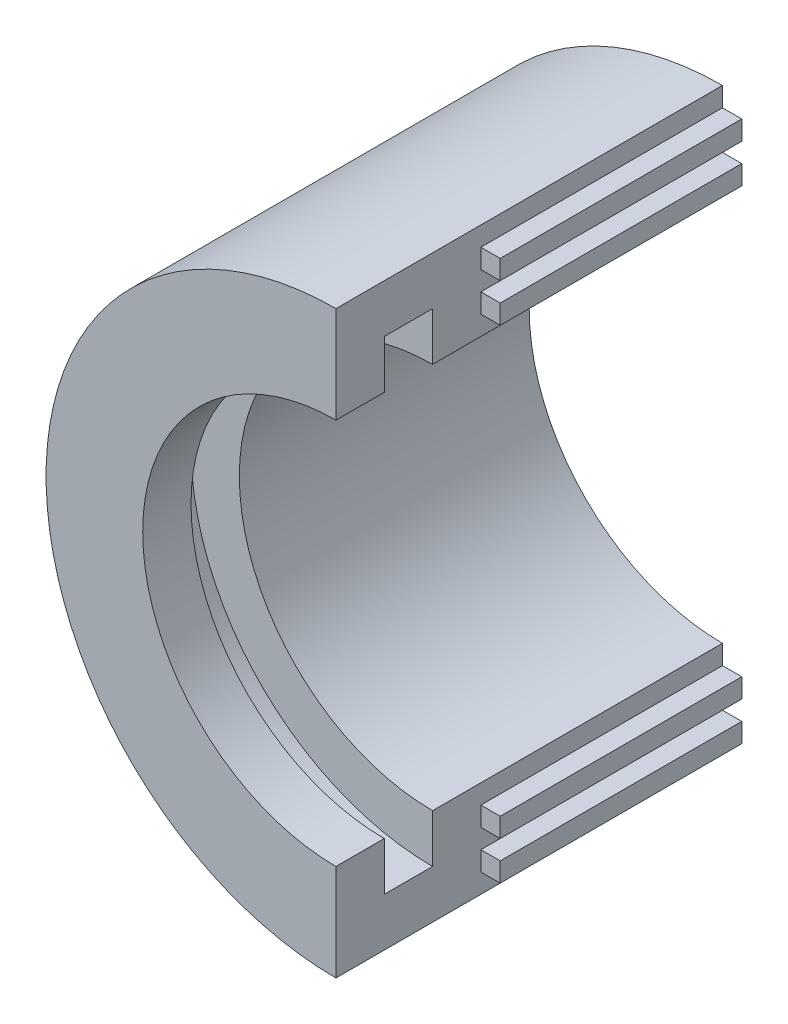
ISO-10303-21;
HEADER;
FILE_DESCRIPTION(('STEP AP214'),'2;1');
FILE_NAME('part.step','',(''),(''),'','','');
FILE_SCHEMA(('AUTOMOTIVE_DESIGN { 1 0 10303 214 1 1 1 1 }'));
ENDSEC;
DATA;
#1=APPLICATION_CONTEXT('core data for automotive mechanical design processes');
#2=APPLICATION_PROTOCOL_DEFINITION('international standard','automotive_design',2000,#1);
#3=PRODUCT_CONTEXT('',#1,'mechanical');
#4=PRODUCT('Part','Part','',(#3));
#5=PRODUCT_RELATED_PRODUCT_CATEGORY('part','',(#4));
#6=PRODUCT_DEFINITION_FORMATION('','',#4);
#7=PRODUCT_DEFINITION_CONTEXT('part definition',#1,'design');
#8=PRODUCT_DEFINITION('design','',#6,#7);
#9=PRODUCT_DEFINITION_SHAPE('','',#8);
#10=(LENGTH_UNIT() NAMED_UNIT(*) SI_UNIT(.MILLI.,.METRE.));
#11=(NAMED_UNIT(*) PLANE_ANGLE_UNIT() SI_UNIT($,.RADIAN.));
#12=(NAMED_UNIT(*) SI_UNIT($,.STERADIAN.) SOLID_ANGLE_UNIT());
#13=UNCERTAINTY_MEASURE_WITH_UNIT(LENGTH_MEASURE(1.E-05),#10,'distance_accuracy_value','');
#14=(GEOMETRIC_REPRESENTATION_CONTEXT(3) GLOBAL_UNCERTAINTY_ASSIGNED_CONTEXT((#13)) GLOBAL_UNIT_ASSIGNED_CONTEXT((#10,
#11,#12)) REPRESENTATION_CONTEXT('',''));
#15=CARTESIAN_POINT('',(0.,0.,0.));
#16=DIRECTION('',(0.,0.,1.));
#17=DIRECTION('',(1.,0.,0.));
#18=AXIS2_PLACEMENT_3D('',#15,#16,#17);
#19=CARTESIAN_POINT('',(0.,76.2,0.));
#20=DIRECTION('',(-1.,0.,0.));
#21=DIRECTION('',(0.,0.,1.));
#22=AXIS2_PLACEMENT_3D('',#19,#20,#21);
#23=PLANE('',#22);
#24=DIRECTION('',(0.,0.,1.));
#25=VECTOR('',#24,1.);
#26=CARTESIAN_POINT('',(0.,-66.04,0.));
#27=LINE('',#26,#25);
#28=CARTESIAN_POINT('',(0.,-66.04,0.));
#29=VERTEX_POINT('',#28);
#30=CARTESIAN_POINT('',(0.,-66.04,63.5));
#31=VERTEX_POINT('',#30);
#32=EDGE_CURVE('E261',#29,#31,#27,.T.);
#33=ORIENTED_EDGE('',*,*,#32,.F.);
#34=DIRECTION('',(0.,-1.,0.));
#35=VECTOR('',#34,1.);
#36=CARTESIAN_POINT('',(0.,76.2,0.));
#37=LINE('',#36,#35);
#38=CARTESIAN_POINT('',(0.,-60.96,0.));
#39=VERTEX_POINT('',#38);
#40=EDGE_CURVE('E413',#39,#29,#37,.T.);
#41=ORIENTED_EDGE('',*,*,#40,.F.);
#42=DIRECTION('',(0.,0.,-1.));
#43=VECTOR('',#42,1.);
#44=CARTESIAN_POINT('',(0.,-60.96,0.));
#45=LINE('',#44,#43);
#46=CARTESIAN_POINT('',(0.,-60.96,63.5));
#47=VERTEX_POINT('',#46);
#48=EDGE_CURVE('E292',#47,#39,#45,.T.);
#49=ORIENTED_EDGE('',*,*,#48,.F.);
#50=DIRECTION('',(0.,-1.,0.));
#51=VECTOR('',#50,1.);
#52=CARTESIAN_POINT('',(0.,-55.88,63.5));
#53=LINE('',#52,#51);
#54=CARTESIAN_POINT('',(0.,-55.88,63.5));
#55=VERTEX_POINT('',#54);
#56=EDGE_CURVE('E301',#55,#47,#53,.T.);
#57=ORIENTED_EDGE('',*,*,#56,.F.);
#58=DIRECTION('',(0.,0.,1.));
#59=VECTOR('',#58,1.);
#60=CARTESIAN_POINT('',(0.,-55.88,0.));
#61=LINE('',#60,#59);
#62=CARTESIAN_POINT('',(0.,-55.88,0.));
#63=VERTEX_POINT('',#62);
#64=EDGE_CURVE('E287',#63,#55,#61,.T.);
#65=ORIENTED_EDGE('',*,*,#64,.F.);
#66=CARTESIAN_POINT('',(0.,-50.8,0.));
#67=VERTEX_POINT('',#66);
#68=EDGE_CURVE('E321',#67,#63,#37,.T.);
#69=ORIENTED_EDGE('',*,*,#68,.F.);
#70=DIRECTION('',(0.,0.,-1.));
#71=VECTOR('',#70,1.);
#72=CARTESIAN_POINT('',(0.,-50.8,101.6));
#73=LINE('',#72,#71);
#74=CARTESIAN_POINT('',(0.,-50.8,76.2));
#75=VERTEX_POINT('',#74);
#76=EDGE_CURVE('E41',#75,#67,#73,.T.);
#77=ORIENTED_EDGE('',*,*,#76,.F.);
#78=DIRECTION('',(0.,-1.,0.));
#79=VECTOR('',#78,1.);
#80=CARTESIAN_POINT('',(0.,0.,76.2));
#81=LINE('',#80,#79);
#82=CARTESIAN_POINT('',(0.,-63.5,76.2));
#83=VERTEX_POINT('',#82);
#84=EDGE_CURVE('E328',#75,#83,#81,.T.);
#85=ORIENTED_EDGE('',*,*,#84,.T.);
#86=DIRECTION('',(0.,0.,1.));
#87=VECTOR('',#86,1.);
#88=CARTESIAN_POINT('',(0.,-63.5,76.2));
#89=LINE('',#88,#87);
#90=CARTESIAN_POINT('',(0.,-63.5,88.9));
#91=VERTEX_POINT('',#90);
#92=EDGE_CURVE('E331',#91,#83,#89,.F.);
#93=ORIENTED_EDGE('',*,*,#92,.F.);
#94=DIRECTION('',(0.,-1.,0.));
#95=VECTOR('',#94,1.);
#96=CARTESIAN_POINT('',(0.,0.,88.9));
#97=LINE('',#96,#95);
#98=CARTESIAN_POINT('',(0.,-50.8,88.9));
#99=VERTEX_POINT('',#98);
#100=EDGE_CURVE('E335',#99,#91,#97,.T.);
#101=ORIENTED_EDGE('',*,*,#100,.F.);
#102=DIRECTION('',(0.,0.,1.));
#103=VECTOR('',#102,1.);
#104=CARTESIAN_POINT('',(0.,-50.8,88.9));
#105=LINE('',#104,#103);
#106=CARTESIAN_POINT('',(0.,-50.8,101.6));
#107=VERTEX_POINT('',#106);
#108=EDGE_CURVE('E338',#107,#99,#105,.F.);
#109=ORIENTED_EDGE('',*,*,#108,.F.);
#110=DIRECTION('',(0.,-1.,0.));
#111=VECTOR('',#110,1.);
#112=CARTESIAN_POINT('',(0.,76.2,101.6));
#113=LINE('',#112,#111);
#114=CARTESIAN_POINT('',(0.,-76.2,101.6));
#115=VERTEX_POINT('',#114);
#116=EDGE_CURVE('E317',#107,#115,#113,.T.);
#117=ORIENTED_EDGE('',*,*,#116,.T.);
#118=DIRECTION('',(0.,0.,1.));
#119=VECTOR('',#118,1.);
#120=CARTESIAN_POINT('',(0.,-76.2,0.));
#121=LINE('',#120,#119);
#122=CARTESIAN_POINT('',(0.,-76.2,0.));
#123=VERTEX_POINT('',#122);
#124=EDGE_CURVE('E325',#123,#115,#121,.T.);
#125=ORIENTED_EDGE('',*,*,#124,.F.);
#126=CARTESIAN_POINT('',(0.,-71.12,0.));
#127=VERTEX_POINT('',#126);
#128=EDGE_CURVE('E324',#127,#123,#37,.T.);
#129=ORIENTED_EDGE('',*,*,#128,.F.);
#130=DIRECTION('',(0.,0.,-1.));
#131=VECTOR('',#130,1.);
#132=CARTESIAN_POINT('',(0.,-71.12,0.));
#133=LINE('',#132,#131);
#134=CARTESIAN_POINT('',(0.,-71.12,63.5));
#135=VERTEX_POINT('',#134);
#136=EDGE_CURVE('E266',#135,#127,#133,.T.);
#137=ORIENTED_EDGE('',*,*,#136,.F.);
#138=DIRECTION('',(0.,-1.,0.));
#139=VECTOR('',#138,1.);
#140=CARTESIAN_POINT('',(0.,-66.04,63.5));
#141=LINE('',#140,#139);
#142=EDGE_CURVE('E274',#31,#135,#141,.T.);
#143=ORIENTED_EDGE('',*,*,#142,.F.);
#144=EDGE_LOOP('',(#33,#41,#49,#57,#65,#69,#77,#85,#93,#101,#109,#117,#125,#129,#137,#143));
#145=FACE_BOUND('',#144,.T.);
#146=ADVANCED_FACE('F33',(#145),#23,.F.);
#147=CARTESIAN_POINT('',(0.,0.,101.6));
#148=DIRECTION('',(0.,0.,-1.));
#149=DIRECTION('',(-1.,0.,0.));
#150=AXIS2_PLACEMENT_3D('',#147,#148,#149);
#151=CYLINDRICAL_SURFACE('',#150,76.2);
#152=CARTESIAN_POINT('',(0.,0.,101.6));
#153=DIRECTION('',(0.,0.,1.));
#154=DIRECTION('',(1.,0.,0.));
#155=AXIS2_PLACEMENT_3D('',#152,#153,#154);
#156=CIRCLE('',#155,76.2);
#157=CARTESIAN_POINT('',(0.,76.2,101.6));
#158=VERTEX_POINT('',#157);
#159=EDGE_CURVE('E362',#158,#115,#156,.T.);
#160=ORIENTED_EDGE('',*,*,#159,.F.);
#161=DIRECTION('',(0.,0.,1.));
#162=VECTOR('',#161,1.);
#163=CARTESIAN_POINT('',(0.,76.2,0.));
#164=LINE('',#163,#162);
#165=CARTESIAN_POINT('',(0.,76.2,0.));
#166=VERTEX_POINT('',#165);
#167=EDGE_CURVE('E319',#166,#158,#164,.T.);
#168=ORIENTED_EDGE('',*,*,#167,.F.);
#169=CARTESIAN_POINT('',(0.,0.,0.));
#170=DIRECTION('',(0.,0.,1.));
#171=DIRECTION('',(1.,0.,0.));
#172=AXIS2_PLACEMENT_3D('',#169,#170,#171);
#173=CIRCLE('',#172,76.2);
#174=EDGE_CURVE('E361',#166,#123,#173,.T.);
#175=ORIENTED_EDGE('',*,*,#174,.T.);
#176=ORIENTED_EDGE('',*,*,#124,.T.);
#177=EDGE_LOOP('',(#160,#168,#175,#176));
#178=FACE_BOUND('',#177,.T.);
#179=ADVANCED_FACE('F35',(#178),#151,.T.);
#180=CARTESIAN_POINT('',(0.,0.,101.6));
#181=DIRECTION('',(0.,0.,1.));
#182=DIRECTION('',(1.,0.,0.));
#183=AXIS2_PLACEMENT_3D('',#180,#181,#182);
#184=PLANE('',#183);
#185=CARTESIAN_POINT('',(0.,50.8,101.6));
#186=VERTEX_POINT('',#185);
#187=EDGE_CURVE('E322',#158,#186,#113,.T.);
#188=ORIENTED_EDGE('',*,*,#187,.F.);
#189=ORIENTED_EDGE('',*,*,#159,.T.);
#190=ORIENTED_EDGE('',*,*,#116,.F.);
#191=CARTESIAN_POINT('',(0.,0.,101.6));
#192=DIRECTION('',(0.,0.,1.));
#193=DIRECTION('',(1.,0.,0.));
#194=AXIS2_PLACEMENT_3D('',#191,#192,#193);
#195=CIRCLE('',#194,50.8);
#196=EDGE_CURVE('E356',#186,#107,#195,.T.);
#197=ORIENTED_EDGE('',*,*,#196,.F.);
#198=EDGE_LOOP('',(#188,#189,#190,#197));
#199=FACE_BOUND('',#198,.T.);
#200=ADVANCED_FACE('F404',(#199),#184,.T.);
#201=CARTESIAN_POINT('',(0.,0.,0.));
#202=DIRECTION('',(0.,0.,1.));
#203=DIRECTION('',(1.,0.,0.));
#204=AXIS2_PLACEMENT_3D('',#201,#202,#203);
#205=PLANE('',#204);
#206=ORIENTED_EDGE('',*,*,#174,.F.);
#207=CARTESIAN_POINT('',(0.,71.12,0.));
#208=VERTEX_POINT('',#207);
#209=EDGE_CURVE('E200',#166,#208,#37,.T.);
#210=ORIENTED_EDGE('',*,*,#209,.T.);
#211=DIRECTION('',(-1.,0.,0.));
#212=VECTOR('',#211,1.);
#213=CARTESIAN_POINT('',(5.08,71.12,0.));
#214=LINE('',#213,#212);
#215=CARTESIAN_POINT('',(5.08,71.12,0.));
#216=VERTEX_POINT('',#215);
#217=EDGE_CURVE('E194',#216,#208,#214,.T.);
#218=ORIENTED_EDGE('',*,*,#217,.F.);
#219=DIRECTION('',(0.,-1.,0.));
#220=VECTOR('',#219,1.);
#221=CARTESIAN_POINT('',(5.08,66.04,0.));
#222=LINE('',#221,#220);
#223=CARTESIAN_POINT('',(5.08,66.04,0.));
#224=VERTEX_POINT('',#223);
#225=EDGE_CURVE('E198',#216,#224,#222,.T.);
#226=ORIENTED_EDGE('',*,*,#225,.T.);
#227=DIRECTION('',(-1.,0.,0.));
#228=VECTOR('',#227,1.);
#229=CARTESIAN_POINT('',(5.08,66.04,0.));
#230=LINE('',#229,#228);
#231=CARTESIAN_POINT('',(0.,66.04,0.));
#232=VERTEX_POINT('',#231);
#233=EDGE_CURVE('E224',#224,#232,#230,.T.);
#234=ORIENTED_EDGE('',*,*,#233,.T.);
#235=CARTESIAN_POINT('',(0.,60.96,0.));
#236=VERTEX_POINT('',#235);
#237=EDGE_CURVE('E320',#232,#236,#37,.T.);
#238=ORIENTED_EDGE('',*,*,#237,.T.);
#239=DIRECTION('',(-1.,0.,0.));
#240=VECTOR('',#239,1.);
#241=CARTESIAN_POINT('',(5.08,60.96,0.));
#242=LINE('',#241,#240);
#243=CARTESIAN_POINT('',(5.08,60.96,0.));
#244=VERTEX_POINT('',#243);
#245=EDGE_CURVE('E258',#244,#236,#242,.T.);
#246=ORIENTED_EDGE('',*,*,#245,.F.);
#247=DIRECTION('',(0.,-1.,0.));
#248=VECTOR('',#247,1.);
#249=CARTESIAN_POINT('',(5.08,55.88,0.));
#250=LINE('',#249,#248);
#251=CARTESIAN_POINT('',(5.08,55.88,0.));
#252=VERTEX_POINT('',#251);
#253=EDGE_CURVE('E234',#244,#252,#250,.T.);
#254=ORIENTED_EDGE('',*,*,#253,.T.);
#255=DIRECTION('',(-1.,0.,0.));
#256=VECTOR('',#255,1.);
#257=CARTESIAN_POINT('',(5.08,55.88,0.));
#258=LINE('',#257,#256);
#259=CARTESIAN_POINT('',(0.,55.88,0.));
#260=VERTEX_POINT('',#259);
#261=EDGE_CURVE('E247',#252,#260,#258,.T.);
#262=ORIENTED_EDGE('',*,*,#261,.T.);
#263=CARTESIAN_POINT('',(0.,50.8,0.));
#264=VERTEX_POINT('',#263);
#265=EDGE_CURVE('E381',#260,#264,#37,.T.);
#266=ORIENTED_EDGE('',*,*,#265,.T.);
#267=CARTESIAN_POINT('',(0.,0.,0.));
#268=DIRECTION('',(0.,0.,-1.));
#269=DIRECTION('',(-1.,0.,0.));
#270=AXIS2_PLACEMENT_3D('',#267,#268,#269);
#271=CIRCLE('',#270,50.8);
#272=EDGE_CURVE('E348',#67,#264,#271,.T.);
#273=ORIENTED_EDGE('',*,*,#272,.F.);
#274=ORIENTED_EDGE('',*,*,#68,.T.);
#275=DIRECTION('',(-1.,0.,0.));
#276=VECTOR('',#275,1.);
#277=CARTESIAN_POINT('',(5.08,-55.88,0.));
#278=LINE('',#277,#276);
#279=CARTESIAN_POINT('',(5.08,-55.88,0.));
#280=VERTEX_POINT('',#279);
#281=EDGE_CURVE('E314',#280,#63,#278,.T.);
#282=ORIENTED_EDGE('',*,*,#281,.F.);
#283=DIRECTION('',(0.,1.,0.));
#284=VECTOR('',#283,1.);
#285=CARTESIAN_POINT('',(5.08,-55.88,0.));
#286=LINE('',#285,#284);
#287=CARTESIAN_POINT('',(5.08,-60.96,0.));
#288=VERTEX_POINT('',#287);
#289=EDGE_CURVE('E288',#288,#280,#286,.T.);
#290=ORIENTED_EDGE('',*,*,#289,.F.);
#291=DIRECTION('',(-1.,0.,0.));
#292=VECTOR('',#291,1.);
#293=CARTESIAN_POINT('',(5.08,-60.96,0.));
#294=LINE('',#293,#292);
#295=EDGE_CURVE('E298',#288,#39,#294,.T.);
#296=ORIENTED_EDGE('',*,*,#295,.T.);
#297=ORIENTED_EDGE('',*,*,#40,.T.);
#298=DIRECTION('',(-1.,0.,0.));
#299=VECTOR('',#298,1.);
#300=CARTESIAN_POINT('',(5.08,-66.04,0.));
#301=LINE('',#300,#299);
#302=CARTESIAN_POINT('',(5.08,-66.04,0.));
#303=VERTEX_POINT('',#302);
#304=EDGE_CURVE('E285',#303,#29,#301,.T.);
#305=ORIENTED_EDGE('',*,*,#304,.F.);
#306=DIRECTION('',(0.,1.,0.));
#307=VECTOR('',#306,1.);
#308=CARTESIAN_POINT('',(5.08,-66.04,0.));
#309=LINE('',#308,#307);
#310=CARTESIAN_POINT('',(5.08,-71.12,0.));
#311=VERTEX_POINT('',#310);
#312=EDGE_CURVE('E262',#311,#303,#309,.T.);
#313=ORIENTED_EDGE('',*,*,#312,.F.);
#314=DIRECTION('',(-1.,0.,0.));
#315=VECTOR('',#314,1.);
#316=CARTESIAN_POINT('',(5.08,-71.12,0.));
#317=LINE('',#316,#315);
#318=EDGE_CURVE('E272',#311,#127,#317,.T.);
#319=ORIENTED_EDGE('',*,*,#318,.T.);
#320=ORIENTED_EDGE('',*,*,#128,.T.);
#321=EDGE_LOOP('',(#206,#210,#218,#226,#234,#238,#246,#254,#262,#266,#273,#274,#282,#290,#296,
#297,#305,#313,#319,#320));
#322=FACE_BOUND('',#321,.T.);
#323=ADVANCED_FACE('F197',(#322),#205,.F.);
#324=CARTESIAN_POINT('',(0.,0.,88.9));
#325=DIRECTION('',(0.,0.,1.));
#326=DIRECTION('',(1.,0.,0.));
#327=AXIS2_PLACEMENT_3D('',#324,#325,#326);
#328=PLANE('',#327);
#329=CARTESIAN_POINT('',(0.,0.,88.9));
#330=DIRECTION('',(0.,0.,1.));
#331=DIRECTION('',(1.,0.,0.));
#332=AXIS2_PLACEMENT_3D('',#329,#330,#331);
#333=CIRCLE('',#332,63.5);
#334=CARTESIAN_POINT('',(0.,63.5,88.9));
#335=VERTEX_POINT('',#334);
#336=EDGE_CURVE('E365',#91,#335,#333,.F.);
#337=ORIENTED_EDGE('',*,*,#336,.T.);
#338=CARTESIAN_POINT('',(0.,50.8,88.9));
#339=VERTEX_POINT('',#338);
#340=EDGE_CURVE('E339',#335,#339,#97,.T.);
#341=ORIENTED_EDGE('',*,*,#340,.T.);
#342=CARTESIAN_POINT('',(0.,0.,88.9));
#343=DIRECTION('',(0.,0.,1.));
#344=DIRECTION('',(1.,0.,0.));
#345=AXIS2_PLACEMENT_3D('',#342,#343,#344);
#346=CIRCLE('',#345,50.8);
#347=EDGE_CURVE('E352',#339,#99,#346,.T.);
#348=ORIENTED_EDGE('',*,*,#347,.T.);
#349=ORIENTED_EDGE('',*,*,#100,.T.);
#350=EDGE_LOOP('',(#337,#341,#348,#349));
#351=FACE_BOUND('',#350,.T.);
#352=ADVANCED_FACE('F396',(#351),#328,.F.);
#353=CARTESIAN_POINT('',(0.,0.,88.9));
#354=DIRECTION('',(0.,0.,1.));
#355=DIRECTION('',(1.,0.,0.));
#356=AXIS2_PLACEMENT_3D('',#353,#354,#355);
#357=CYLINDRICAL_SURFACE('',#356,50.8);
#358=ORIENTED_EDGE('',*,*,#196,.T.);
#359=ORIENTED_EDGE('',*,*,#108,.T.);
#360=ORIENTED_EDGE('',*,*,#347,.F.);
#361=DIRECTION('',(0.,0.,1.));
#362=VECTOR('',#361,1.);
#363=CARTESIAN_POINT('',(0.,50.8,88.9));
#364=LINE('',#363,#362);
#365=EDGE_CURVE('E345',#339,#186,#364,.T.);
#366=ORIENTED_EDGE('',*,*,#365,.T.);
#367=EDGE_LOOP('',(#358,#359,#360,#366));
#368=FACE_BOUND('',#367,.T.);
#369=ADVANCED_FACE('F400',(#368),#357,.F.);
#370=CARTESIAN_POINT('',(0.,0.,76.2));
#371=DIRECTION('',(0.,0.,1.));
#372=DIRECTION('',(1.,0.,0.));
#373=AXIS2_PLACEMENT_3D('',#370,#371,#372);
#374=PLANE('',#373);
#375=CARTESIAN_POINT('',(0.,63.5,76.2));
#376=VERTEX_POINT('',#375);
#377=CARTESIAN_POINT('',(0.,50.8,76.2));
#378=VERTEX_POINT('',#377);
#379=EDGE_CURVE('E332',#376,#378,#81,.T.);
#380=ORIENTED_EDGE('',*,*,#379,.F.);
#381=CARTESIAN_POINT('',(0.,0.,76.2));
#382=DIRECTION('',(0.,0.,1.));
#383=DIRECTION('',(1.,0.,0.));
#384=AXIS2_PLACEMENT_3D('',#381,#382,#383);
#385=CIRCLE('',#384,63.5);
#386=EDGE_CURVE('E355',#376,#83,#385,.T.);
#387=ORIENTED_EDGE('',*,*,#386,.T.);
#388=ORIENTED_EDGE('',*,*,#84,.F.);
#389=CARTESIAN_POINT('',(0.,0.,76.2));
#390=DIRECTION('',(0.,0.,1.));
#391=DIRECTION('',(1.,0.,0.));
#392=AXIS2_PLACEMENT_3D('',#389,#390,#391);
#393=CIRCLE('',#392,50.8);
#394=EDGE_CURVE('E351',#378,#75,#393,.T.);
#395=ORIENTED_EDGE('',*,*,#394,.F.);
#396=EDGE_LOOP('',(#380,#387,#388,#395));
#397=FACE_BOUND('',#396,.T.);
#398=ADVANCED_FACE('F388',(#397),#374,.T.);
#399=CARTESIAN_POINT('',(0.,0.,76.2));
#400=DIRECTION('',(0.,0.,1.));
#401=DIRECTION('',(1.,0.,0.));
#402=AXIS2_PLACEMENT_3D('',#399,#400,#401);
#403=CYLINDRICAL_SURFACE('',#402,63.5);
#404=ORIENTED_EDGE('',*,*,#336,.F.);
#405=ORIENTED_EDGE('',*,*,#92,.T.);
#406=ORIENTED_EDGE('',*,*,#386,.F.);
#407=DIRECTION('',(0.,0.,1.));
#408=VECTOR('',#407,1.);
#409=CARTESIAN_POINT('',(0.,63.5,76.2));
#410=LINE('',#409,#408);
#411=EDGE_CURVE('E342',#376,#335,#410,.T.);
#412=ORIENTED_EDGE('',*,*,#411,.T.);
#413=EDGE_LOOP('',(#404,#405,#406,#412));
#414=FACE_BOUND('',#413,.T.);
#415=ADVANCED_FACE('F393',(#414),#403,.F.);
#416=CARTESIAN_POINT('',(0.,0.,101.6));
#417=DIRECTION('',(0.,0.,-1.));
#418=DIRECTION('',(-1.,0.,0.));
#419=AXIS2_PLACEMENT_3D('',#416,#417,#418);
#420=CYLINDRICAL_SURFACE('',#419,50.8);
#421=ORIENTED_EDGE('',*,*,#272,.T.);
#422=DIRECTION('',(0.,0.,-1.));
#423=VECTOR('',#422,1.);
#424=CARTESIAN_POINT('',(0.,50.8,101.6));
#425=LINE('',#424,#423);
#426=EDGE_CURVE('E11',#264,#378,#425,.F.);
#427=ORIENTED_EDGE('',*,*,#426,.T.);
#428=ORIENTED_EDGE('',*,*,#394,.T.);
#429=ORIENTED_EDGE('',*,*,#76,.T.);
#430=EDGE_LOOP('',(#421,#427,#428,#429));
#431=FACE_BOUND('',#430,.T.);
#432=ADVANCED_FACE('F374',(#431),#420,.F.);
#433=DIRECTION('',(0.,1.,0.));
#434=VECTOR('',#433,1.);
#435=CARTESIAN_POINT('',(0.,66.04,63.5));
#436=LINE('',#435,#434);
#437=CARTESIAN_POINT('',(0.,66.04,63.5));
#438=VERTEX_POINT('',#437);
#439=CARTESIAN_POINT('',(0.,71.12,63.5));
#440=VERTEX_POINT('',#439);
#441=EDGE_CURVE('E48',#438,#440,#436,.T.);
#442=ORIENTED_EDGE('',*,*,#441,.T.);
#443=DIRECTION('',(0.,0.,-1.));
#444=VECTOR('',#443,1.);
#445=CARTESIAN_POINT('',(0.,71.12,0.));
#446=LINE('',#445,#444);
#447=EDGE_CURVE('E225',#440,#208,#446,.T.);
#448=ORIENTED_EDGE('',*,*,#447,.T.);
#449=ORIENTED_EDGE('',*,*,#209,.F.);
#450=ORIENTED_EDGE('',*,*,#167,.T.);
#451=ORIENTED_EDGE('',*,*,#187,.T.);
#452=ORIENTED_EDGE('',*,*,#365,.F.);
#453=ORIENTED_EDGE('',*,*,#340,.F.);
#454=ORIENTED_EDGE('',*,*,#411,.F.);
#455=ORIENTED_EDGE('',*,*,#379,.T.);
#456=ORIENTED_EDGE('',*,*,#426,.F.);
#457=ORIENTED_EDGE('',*,*,#265,.F.);
#458=DIRECTION('',(0.,0.,1.));
#459=VECTOR('',#458,1.);
#460=CARTESIAN_POINT('',(0.,55.88,0.));
#461=LINE('',#460,#459);
#462=CARTESIAN_POINT('',(0.,55.88,63.5));
#463=VERTEX_POINT('',#462);
#464=EDGE_CURVE('E238',#260,#463,#461,.T.);
#465=ORIENTED_EDGE('',*,*,#464,.T.);
#466=DIRECTION('',(0.,1.,0.));
#467=VECTOR('',#466,1.);
#468=CARTESIAN_POINT('',(0.,55.88,63.5));
#469=LINE('',#468,#467);
#470=CARTESIAN_POINT('',(0.,60.96,63.5));
#471=VERTEX_POINT('',#470);
#472=EDGE_CURVE('E56',#463,#471,#469,.T.);
#473=ORIENTED_EDGE('',*,*,#472,.T.);
#474=DIRECTION('',(0.,0.,-1.));
#475=VECTOR('',#474,1.);
#476=CARTESIAN_POINT('',(0.,60.96,0.));
#477=LINE('',#476,#475);
#478=EDGE_CURVE('E205',#471,#236,#477,.T.);
#479=ORIENTED_EDGE('',*,*,#478,.T.);
#480=ORIENTED_EDGE('',*,*,#237,.F.);
#481=DIRECTION('',(0.,0.,1.));
#482=VECTOR('',#481,1.);
#483=CARTESIAN_POINT('',(0.,66.04,0.));
#484=LINE('',#483,#482);
#485=EDGE_CURVE('E216',#232,#438,#484,.T.);
#486=ORIENTED_EDGE('',*,*,#485,.T.);
#487=EDGE_LOOP('',(#442,#448,#449,#450,#451,#452,#453,#454,#455,#456,#457,#465,#473,#479,#480,#486));
#488=FACE_BOUND('',#487,.T.);
#489=ADVANCED_FACE('F385',(#488),#23,.F.);
#490=CARTESIAN_POINT('',(5.08,-55.88,0.));
#491=DIRECTION('',(0.,-1.,0.));
#492=DIRECTION('',(0.,0.,-1.));
#493=AXIS2_PLACEMENT_3D('',#490,#491,#492);
#494=PLANE('',#493);
#495=ORIENTED_EDGE('',*,*,#64,.T.);
#496=DIRECTION('',(-1.,0.,0.));
#497=VECTOR('',#496,1.);
#498=CARTESIAN_POINT('',(5.08,-55.88,63.5));
#499=LINE('',#498,#497);
#500=CARTESIAN_POINT('',(5.08,-55.88,63.5));
#501=VERTEX_POINT('',#500);
#502=EDGE_CURVE('E311',#501,#55,#499,.T.);
#503=ORIENTED_EDGE('',*,*,#502,.F.);
#504=DIRECTION('',(0.,0.,1.));
#505=VECTOR('',#504,1.);
#506=CARTESIAN_POINT('',(5.08,-55.88,0.));
#507=LINE('',#506,#505);
#508=EDGE_CURVE('E291',#280,#501,#507,.T.);
#509=ORIENTED_EDGE('',*,*,#508,.F.);
#510=ORIENTED_EDGE('',*,*,#281,.T.);
#511=EDGE_LOOP('',(#495,#503,#509,#510));
#512=FACE_BOUND('',#511,.T.);
#513=ADVANCED_FACE('F428',(#512),#494,.F.);
#514=CARTESIAN_POINT('',(5.08,-55.88,63.5));
#515=DIRECTION('',(0.,0.,-1.));
#516=DIRECTION('',(-1.,0.,0.));
#517=AXIS2_PLACEMENT_3D('',#514,#515,#516);
#518=PLANE('',#517);
#519=ORIENTED_EDGE('',*,*,#56,.T.);
#520=DIRECTION('',(-1.,0.,0.));
#521=VECTOR('',#520,1.);
#522=CARTESIAN_POINT('',(5.08,-60.96,63.5));
#523=LINE('',#522,#521);
#524=CARTESIAN_POINT('',(5.08,-60.96,63.5));
#525=VERTEX_POINT('',#524);
#526=EDGE_CURVE('E308',#525,#47,#523,.T.);
#527=ORIENTED_EDGE('',*,*,#526,.F.);
#528=DIRECTION('',(0.,-1.,0.));
#529=VECTOR('',#528,1.);
#530=CARTESIAN_POINT('',(5.08,-55.88,63.5));
#531=LINE('',#530,#529);
#532=EDGE_CURVE('E294',#501,#525,#531,.T.);
#533=ORIENTED_EDGE('',*,*,#532,.F.);
#534=ORIENTED_EDGE('',*,*,#502,.T.);
#535=EDGE_LOOP('',(#519,#527,#533,#534));
#536=FACE_BOUND('',#535,.T.);
#537=ADVANCED_FACE('F425',(#536),#518,.F.);
#538=CARTESIAN_POINT('',(5.08,-60.96,0.));
#539=DIRECTION('',(0.,1.,0.));
#540=DIRECTION('',(0.,0.,1.));
#541=AXIS2_PLACEMENT_3D('',#538,#539,#540);
#542=PLANE('',#541);
#543=ORIENTED_EDGE('',*,*,#48,.T.);
#544=ORIENTED_EDGE('',*,*,#295,.F.);
#545=DIRECTION('',(0.,0.,-1.));
#546=VECTOR('',#545,1.);
#547=CARTESIAN_POINT('',(5.08,-60.96,0.));
#548=LINE('',#547,#546);
#549=EDGE_CURVE('E296',#525,#288,#548,.T.);
#550=ORIENTED_EDGE('',*,*,#549,.F.);
#551=ORIENTED_EDGE('',*,*,#526,.T.);
#552=EDGE_LOOP('',(#543,#544,#550,#551));
#553=FACE_BOUND('',#552,.T.);
#554=ADVANCED_FACE('F420',(#553),#542,.F.);
#555=CARTESIAN_POINT('',(5.08,0.,0.));
#556=DIRECTION('',(-1.,0.,0.));
#557=DIRECTION('',(0.,0.,1.));
#558=AXIS2_PLACEMENT_3D('',#555,#556,#557);
#559=PLANE('',#558);
#560=ORIENTED_EDGE('',*,*,#289,.T.);
#561=ORIENTED_EDGE('',*,*,#508,.T.);
#562=ORIENTED_EDGE('',*,*,#532,.T.);
#563=ORIENTED_EDGE('',*,*,#549,.T.);
#564=EDGE_LOOP('',(#560,#561,#562,#563));
#565=FACE_BOUND('',#564,.T.);
#566=ADVANCED_FACE('F430',(#565),#559,.F.);
#567=CARTESIAN_POINT('',(5.08,-66.04,0.));
#568=DIRECTION('',(0.,-1.,0.));
#569=DIRECTION('',(0.,0.,-1.));
#570=AXIS2_PLACEMENT_3D('',#567,#568,#569);
#571=PLANE('',#570);
#572=ORIENTED_EDGE('',*,*,#32,.T.);
#573=DIRECTION('',(-1.,0.,0.));
#574=VECTOR('',#573,1.);
#575=CARTESIAN_POINT('',(5.08,-66.04,63.5));
#576=LINE('',#575,#574);
#577=CARTESIAN_POINT('',(5.08,-66.04,63.5));
#578=VERTEX_POINT('',#577);
#579=EDGE_CURVE('E282',#578,#31,#576,.T.);
#580=ORIENTED_EDGE('',*,*,#579,.F.);
#581=DIRECTION('',(0.,0.,1.));
#582=VECTOR('',#581,1.);
#583=CARTESIAN_POINT('',(5.08,-66.04,0.));
#584=LINE('',#583,#582);
#585=EDGE_CURVE('E265',#303,#578,#584,.T.);
#586=ORIENTED_EDGE('',*,*,#585,.F.);
#587=ORIENTED_EDGE('',*,*,#304,.T.);
#588=EDGE_LOOP('',(#572,#580,#586,#587));
#589=FACE_BOUND('',#588,.T.);
#590=ADVANCED_FACE('F432',(#589),#571,.F.);
#591=CARTESIAN_POINT('',(5.08,-66.04,63.5));
#592=DIRECTION('',(0.,0.,-1.));
#593=DIRECTION('',(-1.,0.,0.));
#594=AXIS2_PLACEMENT_3D('',#591,#592,#593);
#595=PLANE('',#594);
#596=ORIENTED_EDGE('',*,*,#142,.T.);
#597=DIRECTION('',(-1.,0.,0.));
#598=VECTOR('',#597,1.);
#599=CARTESIAN_POINT('',(5.08,-71.12,63.5));
#600=LINE('',#599,#598);
#601=CARTESIAN_POINT('',(5.08,-71.12,63.5));
#602=VERTEX_POINT('',#601);
#603=EDGE_CURVE('E279',#602,#135,#600,.T.);
#604=ORIENTED_EDGE('',*,*,#603,.F.);
#605=DIRECTION('',(0.,-1.,0.));
#606=VECTOR('',#605,1.);
#607=CARTESIAN_POINT('',(5.08,-66.04,63.5));
#608=LINE('',#607,#606);
#609=EDGE_CURVE('E268',#578,#602,#608,.T.);
#610=ORIENTED_EDGE('',*,*,#609,.F.);
#611=ORIENTED_EDGE('',*,*,#579,.T.);
#612=EDGE_LOOP('',(#596,#604,#610,#611));
#613=FACE_BOUND('',#612,.T.);
#614=ADVANCED_FACE('F438',(#613),#595,.F.);
#615=CARTESIAN_POINT('',(5.08,-71.12,0.));
#616=DIRECTION('',(0.,1.,0.));
#617=DIRECTION('',(0.,0.,1.));
#618=AXIS2_PLACEMENT_3D('',#615,#616,#617);
#619=PLANE('',#618);
#620=ORIENTED_EDGE('',*,*,#136,.T.);
#621=ORIENTED_EDGE('',*,*,#318,.F.);
#622=DIRECTION('',(0.,0.,-1.));
#623=VECTOR('',#622,1.);
#624=CARTESIAN_POINT('',(5.08,-71.12,0.));
#625=LINE('',#624,#623);
#626=EDGE_CURVE('E270',#602,#311,#625,.T.);
#627=ORIENTED_EDGE('',*,*,#626,.F.);
#628=ORIENTED_EDGE('',*,*,#603,.T.);
#629=EDGE_LOOP('',(#620,#621,#627,#628));
#630=FACE_BOUND('',#629,.T.);
#631=ADVANCED_FACE('F539',(#630),#619,.F.);
#632=CARTESIAN_POINT('',(5.08,-10.16,0.));
#633=DIRECTION('',(-1.,0.,0.));
#634=DIRECTION('',(0.,0.,1.));
#635=AXIS2_PLACEMENT_3D('',#632,#633,#634);
#636=PLANE('',#635);
#637=ORIENTED_EDGE('',*,*,#312,.T.);
#638=ORIENTED_EDGE('',*,*,#585,.T.);
#639=ORIENTED_EDGE('',*,*,#609,.T.);
#640=ORIENTED_EDGE('',*,*,#626,.T.);
#641=EDGE_LOOP('',(#637,#638,#639,#640));
#642=FACE_BOUND('',#641,.T.);
#643=ADVANCED_FACE('F548',(#642),#636,.F.);
#644=CARTESIAN_POINT('',(5.08,60.96,0.));
#645=DIRECTION('',(0.,1.,0.));
#646=DIRECTION('',(0.,0.,1.));
#647=AXIS2_PLACEMENT_3D('',#644,#645,#646);
#648=PLANE('',#647);
#649=ORIENTED_EDGE('',*,*,#478,.F.);
#650=DIRECTION('',(-1.,0.,0.));
#651=VECTOR('',#650,1.);
#652=CARTESIAN_POINT('',(5.08,60.96,63.5));
#653=LINE('',#652,#651);
#654=CARTESIAN_POINT('',(5.08,60.96,63.5));
#655=VERTEX_POINT('',#654);
#656=EDGE_CURVE('E256',#655,#471,#653,.T.);
#657=ORIENTED_EDGE('',*,*,#656,.F.);
#658=DIRECTION('',(0.,0.,-1.));
#659=VECTOR('',#658,1.);
#660=CARTESIAN_POINT('',(5.08,60.96,0.));
#661=LINE('',#660,#659);
#662=EDGE_CURVE('E237',#655,#244,#661,.T.);
#663=ORIENTED_EDGE('',*,*,#662,.T.);
#664=ORIENTED_EDGE('',*,*,#245,.T.);
#665=EDGE_LOOP('',(#649,#657,#663,#664));
#666=FACE_BOUND('',#665,.T.);
#667=ADVANCED_FACE('F557',(#666),#648,.T.);
#668=CARTESIAN_POINT('',(5.08,55.88,63.5));
#669=DIRECTION('',(0.,0.,1.));
#670=DIRECTION('',(0.,-1.,0.));
#671=AXIS2_PLACEMENT_3D('',#668,#669,#670);
#672=PLANE('',#671);
#673=ORIENTED_EDGE('',*,*,#472,.F.);
#674=DIRECTION('',(-1.,0.,0.));
#675=VECTOR('',#674,1.);
#676=CARTESIAN_POINT('',(5.08,55.88,63.5));
#677=LINE('',#676,#675);
#678=CARTESIAN_POINT('',(5.08,55.88,63.5));
#679=VERTEX_POINT('',#678);
#680=EDGE_CURVE('E254',#679,#463,#677,.T.);
#681=ORIENTED_EDGE('',*,*,#680,.F.);
#682=DIRECTION('',(0.,1.,0.));
#683=VECTOR('',#682,1.);
#684=CARTESIAN_POINT('',(5.08,55.88,63.5));
#685=LINE('',#684,#683);
#686=EDGE_CURVE('E241',#679,#655,#685,.T.);
#687=ORIENTED_EDGE('',*,*,#686,.T.);
#688=ORIENTED_EDGE('',*,*,#656,.T.);
#689=EDGE_LOOP('',(#673,#681,#687,#688));
#690=FACE_BOUND('',#689,.T.);
#691=ADVANCED_FACE('F568',(#690),#672,.T.);
#692=CARTESIAN_POINT('',(5.08,55.88,0.));
#693=DIRECTION('',(0.,-1.,0.));
#694=DIRECTION('',(0.,0.,-1.));
#695=AXIS2_PLACEMENT_3D('',#692,#693,#694);
#696=PLANE('',#695);
#697=ORIENTED_EDGE('',*,*,#464,.F.);
#698=ORIENTED_EDGE('',*,*,#261,.F.);
#699=DIRECTION('',(0.,0.,1.));
#700=VECTOR('',#699,1.);
#701=CARTESIAN_POINT('',(5.08,55.88,0.));
#702=LINE('',#701,#700);
#703=EDGE_CURVE('E244',#252,#679,#702,.T.);
#704=ORIENTED_EDGE('',*,*,#703,.T.);
#705=ORIENTED_EDGE('',*,*,#680,.T.);
#706=EDGE_LOOP('',(#697,#698,#704,#705));
#707=FACE_BOUND('',#706,.T.);
#708=ADVANCED_FACE('F576',(#707),#696,.T.);
#709=CARTESIAN_POINT('',(5.08,0.,0.));
#710=DIRECTION('',(-1.,0.,0.));
#711=DIRECTION('',(0.,0.,1.));
#712=AXIS2_PLACEMENT_3D('',#709,#710,#711);
#713=PLANE('',#712);
#714=ORIENTED_EDGE('',*,*,#253,.F.);
#715=ORIENTED_EDGE('',*,*,#662,.F.);
#716=ORIENTED_EDGE('',*,*,#686,.F.);
#717=ORIENTED_EDGE('',*,*,#703,.F.);
#718=EDGE_LOOP('',(#714,#715,#716,#717));
#719=FACE_BOUND('',#718,.T.);
#720=ADVANCED_FACE('F583',(#719),#713,.F.);
#721=CARTESIAN_POINT('',(5.08,71.12,0.));
#722=DIRECTION('',(0.,1.,0.));
#723=DIRECTION('',(0.,0.,1.));
#724=AXIS2_PLACEMENT_3D('',#721,#722,#723);
#725=PLANE('',#724);
#726=ORIENTED_EDGE('',*,*,#447,.F.);
#727=DIRECTION('',(-1.,0.,0.));
#728=VECTOR('',#727,1.);
#729=CARTESIAN_POINT('',(5.08,71.12,63.5));
#730=LINE('',#729,#728);
#731=CARTESIAN_POINT('',(5.08,71.12,63.5));
#732=VERTEX_POINT('',#731);
#733=EDGE_CURVE('E206',#732,#440,#730,.T.);
#734=ORIENTED_EDGE('',*,*,#733,.F.);
#735=DIRECTION('',(0.,0.,-1.));
#736=VECTOR('',#735,1.);
#737=CARTESIAN_POINT('',(5.08,71.12,0.));
#738=LINE('',#737,#736);
#739=EDGE_CURVE('E212',#732,#216,#738,.T.);
#740=ORIENTED_EDGE('',*,*,#739,.T.);
#741=ORIENTED_EDGE('',*,*,#217,.T.);
#742=EDGE_LOOP('',(#726,#734,#740,#741));
#743=FACE_BOUND('',#742,.T.);
#744=ADVANCED_FACE('F218',(#743),#725,.T.);
#745=CARTESIAN_POINT('',(5.08,66.04,63.5));
#746=DIRECTION('',(0.,0.,1.));
#747=DIRECTION('',(0.,-1.,0.));
#748=AXIS2_PLACEMENT_3D('',#745,#746,#747);
#749=PLANE('',#748);
#750=ORIENTED_EDGE('',*,*,#441,.F.);
#751=DIRECTION('',(-1.,0.,0.));
#752=VECTOR('',#751,1.);
#753=CARTESIAN_POINT('',(5.08,66.04,63.5));
#754=LINE('',#753,#752);
#755=CARTESIAN_POINT('',(5.08,66.04,63.5));
#756=VERTEX_POINT('',#755);
#757=EDGE_CURVE('E231',#756,#438,#754,.T.);
#758=ORIENTED_EDGE('',*,*,#757,.F.);
#759=DIRECTION('',(0.,1.,0.));
#760=VECTOR('',#759,1.);
#761=CARTESIAN_POINT('',(5.08,66.04,63.5));
#762=LINE('',#761,#760);
#763=EDGE_CURVE('E219',#756,#732,#762,.T.);
#764=ORIENTED_EDGE('',*,*,#763,.T.);
#765=ORIENTED_EDGE('',*,*,#733,.T.);
#766=EDGE_LOOP('',(#750,#758,#764,#765));
#767=FACE_BOUND('',#766,.T.);
#768=ADVANCED_FACE('F598',(#767),#749,.T.);
#769=CARTESIAN_POINT('',(5.08,66.04,0.));
#770=DIRECTION('',(0.,-1.,0.));
#771=DIRECTION('',(0.,0.,-1.));
#772=AXIS2_PLACEMENT_3D('',#769,#770,#771);
#773=PLANE('',#772);
#774=ORIENTED_EDGE('',*,*,#485,.F.);
#775=ORIENTED_EDGE('',*,*,#233,.F.);
#776=DIRECTION('',(0.,0.,1.));
#777=VECTOR('',#776,1.);
#778=CARTESIAN_POINT('',(5.08,66.04,0.));
#779=LINE('',#778,#777);
#780=EDGE_CURVE('E215',#224,#756,#779,.T.);
#781=ORIENTED_EDGE('',*,*,#780,.T.);
#782=ORIENTED_EDGE('',*,*,#757,.T.);
#783=EDGE_LOOP('',(#774,#775,#781,#782));
#784=FACE_BOUND('',#783,.T.);
#785=ADVANCED_FACE('F605',(#784),#773,.T.);
#786=CARTESIAN_POINT('',(5.08,10.16,0.));
#787=DIRECTION('',(-1.,0.,0.));
#788=DIRECTION('',(0.,0.,1.));
#789=AXIS2_PLACEMENT_3D('',#786,#787,#788);
#790=PLANE('',#789);
#791=ORIENTED_EDGE('',*,*,#225,.F.);
#792=ORIENTED_EDGE('',*,*,#739,.F.);
#793=ORIENTED_EDGE('',*,*,#763,.F.);
#794=ORIENTED_EDGE('',*,*,#780,.F.);
#795=EDGE_LOOP('',(#791,#792,#793,#794));
#796=FACE_BOUND('',#795,.T.);
#797=ADVANCED_FACE('F210',(#796),#790,.F.);
#798=CLOSED_SHELL('',(#146,#179,#200,#323,#352,#369,#398,#415,#432,#489,#513,#537,#554,#566,
#590,#614,#631,#643,#667,#691,#708,#720,#744,#768,#785,#797));
#799=MANIFOLD_SOLID_BREP('B2',#798);
#800=ADVANCED_BREP_SHAPE_REPRESENTATION('',(#18,#799),#14);
#801=SHAPE_DEFINITION_REPRESENTATION(#9,#800);
ENDSEC;
END-ISO-10303-21;
